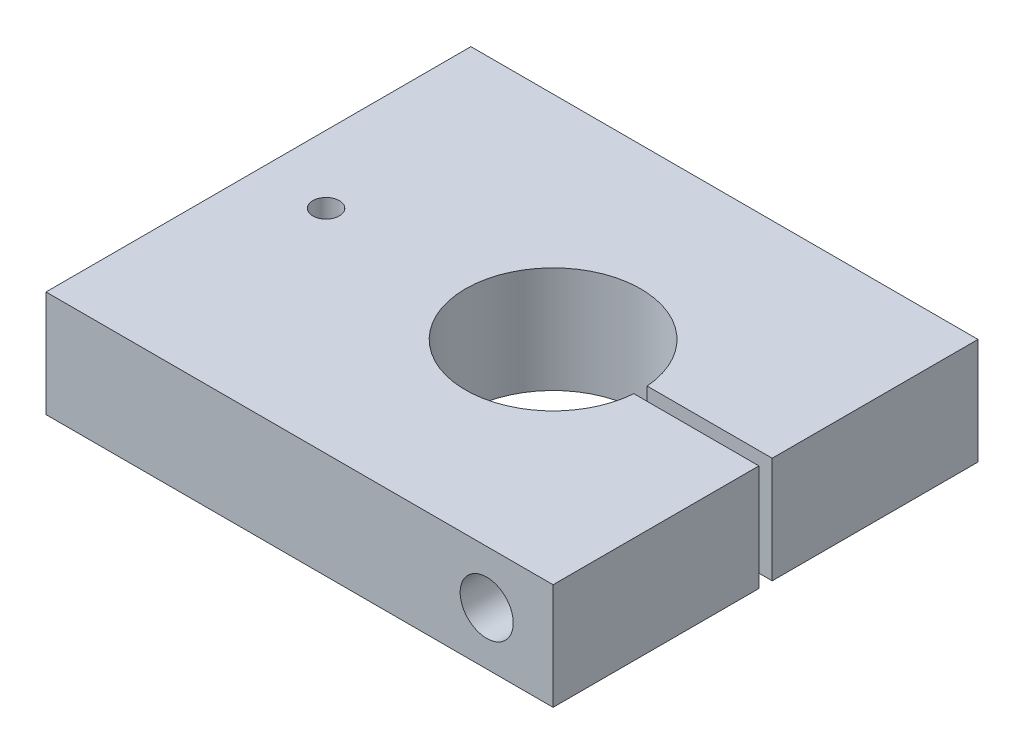
ISO-10303-21;
HEADER;
FILE_DESCRIPTION(('STEP AP214'),'2;1');
FILE_NAME('part.step','',(''),(''),'','','');
FILE_SCHEMA(('AUTOMOTIVE_DESIGN { 1 0 10303 214 1 1 1 1 }'));
ENDSEC;
DATA;
#1=APPLICATION_CONTEXT('core data for automotive mechanical design processes');
#2=APPLICATION_PROTOCOL_DEFINITION('international standard','automotive_design',2000,#1);
#3=PRODUCT_CONTEXT('',#1,'mechanical');
#4=PRODUCT('Part','Part','',(#3));
#5=PRODUCT_RELATED_PRODUCT_CATEGORY('part','',(#4));
#6=PRODUCT_DEFINITION_FORMATION('','',#4);
#7=PRODUCT_DEFINITION_CONTEXT('part definition',#1,'design');
#8=PRODUCT_DEFINITION('design','',#6,#7);
#9=PRODUCT_DEFINITION_SHAPE('','',#8);
#10=(LENGTH_UNIT() NAMED_UNIT(*) SI_UNIT(.MILLI.,.METRE.));
#11=(NAMED_UNIT(*) PLANE_ANGLE_UNIT() SI_UNIT($,.RADIAN.));
#12=(NAMED_UNIT(*) SI_UNIT($,.STERADIAN.) SOLID_ANGLE_UNIT());
#13=UNCERTAINTY_MEASURE_WITH_UNIT(LENGTH_MEASURE(1.E-05),#10,'distance_accuracy_value','');
#14=(GEOMETRIC_REPRESENTATION_CONTEXT(3) GLOBAL_UNCERTAINTY_ASSIGNED_CONTEXT((#13)) GLOBAL_UNIT_ASSIGNED_CONTEXT((#10,
#11,#12)) REPRESENTATION_CONTEXT('',''));
#15=CARTESIAN_POINT('',(0.,0.,0.));
#16=DIRECTION('',(0.,0.,1.));
#17=DIRECTION('',(1.,0.,0.));
#18=AXIS2_PLACEMENT_3D('',#15,#16,#17);
#19=CARTESIAN_POINT('',(203.2,25.4,0.));
#20=DIRECTION('',(-1.,0.,0.));
#21=DIRECTION('',(0.,0.,1.));
#22=AXIS2_PLACEMENT_3D('',#19,#20,#21);
#23=PLANE('',#22);
#24=DIRECTION('',(0.,0.,-1.));
#25=VECTOR('',#24,1.);
#26=CARTESIAN_POINT('',(203.2,0.,0.));
#27=LINE('',#26,#25);
#28=CARTESIAN_POINT('',(203.2,0.,0.));
#29=VERTEX_POINT('',#28);
#30=CARTESIAN_POINT('',(203.2,0.,-49.2125));
#31=VERTEX_POINT('',#30);
#32=EDGE_CURVE('E121',#29,#31,#27,.T.);
#33=ORIENTED_EDGE('',*,*,#32,.T.);
#34=DIRECTION('',(0.,1.,0.));
#35=VECTOR('',#34,1.);
#36=CARTESIAN_POINT('',(203.2,0.,-49.2125));
#37=LINE('',#36,#35);
#38=CARTESIAN_POINT('',(203.2,25.4,-49.2125));
#39=VERTEX_POINT('',#38);
#40=EDGE_CURVE('E115',#31,#39,#37,.T.);
#41=ORIENTED_EDGE('',*,*,#40,.T.);
#42=DIRECTION('',(0.,0.,-1.));
#43=VECTOR('',#42,1.);
#44=CARTESIAN_POINT('',(203.2,25.4,0.));
#45=LINE('',#44,#43);
#46=CARTESIAN_POINT('',(203.2,25.4,0.));
#47=VERTEX_POINT('',#46);
#48=EDGE_CURVE('E172',#47,#39,#45,.T.);
#49=ORIENTED_EDGE('',*,*,#48,.F.);
#50=DIRECTION('',(0.,-1.,0.));
#51=VECTOR('',#50,1.);
#52=CARTESIAN_POINT('',(203.2,25.4,0.));
#53=LINE('',#52,#51);
#54=EDGE_CURVE('E137',#47,#29,#53,.T.);
#55=ORIENTED_EDGE('',*,*,#54,.T.);
#56=EDGE_LOOP('',(#33,#41,#49,#55));
#57=FACE_BOUND('',#56,.T.);
#58=ADVANCED_FACE('F32',(#57),#23,.F.);
#59=CARTESIAN_POINT('',(187.325,12.7,-101.6));
#60=DIRECTION('',(0.,0.,1.));
#61=DIRECTION('',(1.,0.,0.));
#62=AXIS2_PLACEMENT_3D('',#59,#60,#61);
#63=CYLINDRICAL_SURFACE('',#62,6.34999999999997);
#64=CARTESIAN_POINT('',(187.325,12.7,-49.2125));
#65=DIRECTION('',(0.,0.,1.));
#66=DIRECTION('',(1.,0.,0.));
#67=AXIS2_PLACEMENT_3D('',#64,#65,#66);
#68=CIRCLE('',#67,6.34999999999997);
#69=CARTESIAN_POINT('',(193.675,12.7,-49.2125));
#70=VERTEX_POINT('',#69);
#71=EDGE_CURVE('E36',#70,#70,#68,.F.);
#72=ORIENTED_EDGE('',*,*,#71,.T.);
#73=EDGE_LOOP('',(#72));
#74=FACE_BOUND('',#73,.T.);
#75=CARTESIAN_POINT('',(187.325,12.7,0.));
#76=DIRECTION('',(0.,0.,1.));
#77=DIRECTION('',(1.,0.,0.));
#78=AXIS2_PLACEMENT_3D('',#75,#76,#77);
#79=CIRCLE('',#78,6.34999999999997);
#80=CARTESIAN_POINT('',(193.675,12.7,0.));
#81=VERTEX_POINT('',#80);
#82=EDGE_CURVE('E159',#81,#81,#79,.T.);
#83=ORIENTED_EDGE('',*,*,#82,.T.);
#84=EDGE_LOOP('',(#83));
#85=FACE_BOUND('',#84,.T.);
#86=ADVANCED_FACE('F189',(#74,#85),#63,.F.);
#87=CARTESIAN_POINT('',(0.,25.4,0.));
#88=DIRECTION('',(0.,-1.,0.));
#89=DIRECTION('',(0.,0.,-1.));
#90=AXIS2_PLACEMENT_3D('',#87,#88,#89);
#91=PLANE('',#90);
#92=ORIENTED_EDGE('',*,*,#48,.T.);
#93=DIRECTION('',(1.,0.,0.));
#94=VECTOR('',#93,1.);
#95=CARTESIAN_POINT('',(203.2,25.4,-49.2125));
#96=LINE('',#95,#94);
#97=CARTESIAN_POINT('',(173.294780897392,25.4,-49.2125));
#98=VERTEX_POINT('',#97);
#99=EDGE_CURVE('E107',#98,#39,#96,.T.);
#100=ORIENTED_EDGE('',*,*,#99,.F.);
#101=CARTESIAN_POINT('',(152.4,25.4,-50.8));
#102=DIRECTION('',(0.,1.,0.));
#103=DIRECTION('',(0.,0.,1.));
#104=AXIS2_PLACEMENT_3D('',#101,#102,#103);
#105=CIRCLE('',#104,20.955);
#106=CARTESIAN_POINT('',(173.294780897392,25.4,-52.3875));
#107=VERTEX_POINT('',#106);
#108=EDGE_CURVE('E122',#107,#98,#105,.T.);
#109=ORIENTED_EDGE('',*,*,#108,.F.);
#110=DIRECTION('',(-1.,0.,0.));
#111=VECTOR('',#110,1.);
#112=CARTESIAN_POINT('',(203.2,25.4,-52.3875));
#113=LINE('',#112,#111);
#114=CARTESIAN_POINT('',(203.2,25.4,-52.3875));
#115=VERTEX_POINT('',#114);
#116=EDGE_CURVE('E57',#115,#107,#113,.T.);
#117=ORIENTED_EDGE('',*,*,#116,.F.);
#118=CARTESIAN_POINT('',(203.2,25.4,-101.6));
#119=VERTEX_POINT('',#118);
#120=EDGE_CURVE('E114',#115,#119,#45,.T.);
#121=ORIENTED_EDGE('',*,*,#120,.T.);
#122=DIRECTION('',(-1.,0.,0.));
#123=VECTOR('',#122,1.);
#124=CARTESIAN_POINT('',(81.950976157473,25.4,-101.6));
#125=LINE('',#124,#123);
#126=CARTESIAN_POINT('',(81.950976157473,25.4,-101.6));
#127=VERTEX_POINT('',#126);
#128=EDGE_CURVE('E174',#119,#127,#125,.T.);
#129=ORIENTED_EDGE('',*,*,#128,.T.);
#130=DIRECTION('',(0.,0.,1.));
#131=VECTOR('',#130,1.);
#132=CARTESIAN_POINT('',(81.950976157473,25.4,-101.6));
#133=LINE('',#132,#131);
#134=CARTESIAN_POINT('',(81.950976157473,25.4,0.));
#135=VERTEX_POINT('',#134);
#136=EDGE_CURVE('E175',#127,#135,#133,.T.);
#137=ORIENTED_EDGE('',*,*,#136,.T.);
#138=DIRECTION('',(1.,0.,0.));
#139=VECTOR('',#138,1.);
#140=CARTESIAN_POINT('',(81.950976157473,25.4,0.));
#141=LINE('',#140,#139);
#142=EDGE_CURVE('E130',#135,#47,#141,.T.);
#143=ORIENTED_EDGE('',*,*,#142,.T.);
#144=EDGE_LOOP('',(#92,#100,#109,#117,#121,#129,#137,#143));
#145=FACE_BOUND('',#144,.T.);
#146=CARTESIAN_POINT('',(98.1075,25.4,-50.8));
#147=DIRECTION('',(0.,1.,0.));
#148=DIRECTION('',(0.,0.,1.));
#149=AXIS2_PLACEMENT_3D('',#146,#147,#148);
#150=CIRCLE('',#149,3.175);
#151=CARTESIAN_POINT('',(98.1075,25.4,-47.625));
#152=VERTEX_POINT('',#151);
#153=EDGE_CURVE('E166',#152,#152,#150,.T.);
#154=ORIENTED_EDGE('',*,*,#153,.F.);
#155=EDGE_LOOP('',(#154));
#156=FACE_BOUND('',#155,.T.);
#157=ADVANCED_FACE('F181',(#145,#156),#91,.F.);
#158=CARTESIAN_POINT('',(0.,0.,0.));
#159=DIRECTION('',(0.,-1.,0.));
#160=DIRECTION('',(0.,0.,-1.));
#161=AXIS2_PLACEMENT_3D('',#158,#159,#160);
#162=PLANE('',#161);
#163=DIRECTION('',(1.,0.,0.));
#164=VECTOR('',#163,1.);
#165=CARTESIAN_POINT('',(203.2,0.,-49.2125));
#166=LINE('',#165,#164);
#167=CARTESIAN_POINT('',(173.294780897392,0.,-49.2125));
#168=VERTEX_POINT('',#167);
#169=EDGE_CURVE('E49',#168,#31,#166,.T.);
#170=ORIENTED_EDGE('',*,*,#169,.T.);
#171=ORIENTED_EDGE('',*,*,#32,.F.);
#172=DIRECTION('',(1.,0.,0.));
#173=VECTOR('',#172,1.);
#174=CARTESIAN_POINT('',(81.950976157473,0.,0.));
#175=LINE('',#174,#173);
#176=CARTESIAN_POINT('',(81.950976157473,0.,0.));
#177=VERTEX_POINT('',#176);
#178=EDGE_CURVE('E135',#177,#29,#175,.T.);
#179=ORIENTED_EDGE('',*,*,#178,.F.);
#180=DIRECTION('',(0.,0.,1.));
#181=VECTOR('',#180,1.);
#182=CARTESIAN_POINT('',(81.950976157473,0.,-101.6));
#183=LINE('',#182,#181);
#184=CARTESIAN_POINT('',(81.950976157473,0.,-101.6));
#185=VERTEX_POINT('',#184);
#186=EDGE_CURVE('E133',#185,#177,#183,.T.);
#187=ORIENTED_EDGE('',*,*,#186,.F.);
#188=DIRECTION('',(-1.,0.,0.));
#189=VECTOR('',#188,1.);
#190=CARTESIAN_POINT('',(81.950976157473,0.,-101.6));
#191=LINE('',#190,#189);
#192=CARTESIAN_POINT('',(203.2,0.,-101.6));
#193=VERTEX_POINT('',#192);
#194=EDGE_CURVE('E120',#193,#185,#191,.T.);
#195=ORIENTED_EDGE('',*,*,#194,.F.);
#196=CARTESIAN_POINT('',(203.2,0.,-52.3875));
#197=VERTEX_POINT('',#196);
#198=EDGE_CURVE('E112',#197,#193,#27,.T.);
#199=ORIENTED_EDGE('',*,*,#198,.F.);
#200=DIRECTION('',(-1.,0.,0.));
#201=VECTOR('',#200,1.);
#202=CARTESIAN_POINT('',(203.2,0.,-52.3875));
#203=LINE('',#202,#201);
#204=CARTESIAN_POINT('',(173.294780897392,0.,-52.3875));
#205=VERTEX_POINT('',#204);
#206=EDGE_CURVE('E97',#197,#205,#203,.T.);
#207=ORIENTED_EDGE('',*,*,#206,.T.);
#208=CARTESIAN_POINT('',(152.4,0.,-50.8));
#209=DIRECTION('',(0.,1.,0.));
#210=DIRECTION('',(0.,0.,1.));
#211=AXIS2_PLACEMENT_3D('',#208,#209,#210);
#212=CIRCLE('',#211,20.955);
#213=EDGE_CURVE('E126',#205,#168,#212,.T.);
#214=ORIENTED_EDGE('',*,*,#213,.T.);
#215=EDGE_LOOP('',(#170,#171,#179,#187,#195,#199,#207,#214));
#216=FACE_BOUND('',#215,.T.);
#217=CARTESIAN_POINT('',(98.1075,0.,-50.8));
#218=DIRECTION('',(0.,1.,0.));
#219=DIRECTION('',(0.,0.,1.));
#220=AXIS2_PLACEMENT_3D('',#217,#218,#219);
#221=CIRCLE('',#220,3.175);
#222=CARTESIAN_POINT('',(98.1075,0.,-47.625));
#223=VERTEX_POINT('',#222);
#224=EDGE_CURVE('E163',#223,#223,#221,.T.);
#225=ORIENTED_EDGE('',*,*,#224,.T.);
#226=EDGE_LOOP('',(#225));
#227=FACE_BOUND('',#226,.T.);
#228=ADVANCED_FACE('F117',(#216,#227),#162,.T.);
#229=ORIENTED_EDGE('',*,*,#120,.F.);
#230=DIRECTION('',(0.,1.,0.));
#231=VECTOR('',#230,1.);
#232=CARTESIAN_POINT('',(203.2,0.,-52.3875));
#233=LINE('',#232,#231);
#234=EDGE_CURVE('E101',#197,#115,#233,.T.);
#235=ORIENTED_EDGE('',*,*,#234,.F.);
#236=ORIENTED_EDGE('',*,*,#198,.T.);
#237=DIRECTION('',(0.,-1.,0.));
#238=VECTOR('',#237,1.);
#239=CARTESIAN_POINT('',(203.2,25.4,-101.6));
#240=LINE('',#239,#238);
#241=EDGE_CURVE('E11',#119,#193,#240,.T.);
#242=ORIENTED_EDGE('',*,*,#241,.F.);
#243=EDGE_LOOP('',(#229,#235,#236,#242));
#244=FACE_BOUND('',#243,.T.);
#245=ADVANCED_FACE('F34',(#244),#23,.F.);
#246=CARTESIAN_POINT('',(81.950976157473,25.4,-101.6));
#247=DIRECTION('',(0.,0.,1.));
#248=DIRECTION('',(1.,0.,0.));
#249=AXIS2_PLACEMENT_3D('',#246,#247,#248);
#250=PLANE('',#249);
#251=CARTESIAN_POINT('',(187.325,12.7,-101.6));
#252=DIRECTION('',(0.,0.,1.));
#253=DIRECTION('',(1.,0.,0.));
#254=AXIS2_PLACEMENT_3D('',#251,#252,#253);
#255=CIRCLE('',#254,6.34999999999997);
#256=CARTESIAN_POINT('',(193.675,12.7,-101.6));
#257=VERTEX_POINT('',#256);
#258=EDGE_CURVE('E160',#257,#257,#255,.T.);
#259=ORIENTED_EDGE('',*,*,#258,.T.);
#260=EDGE_LOOP('',(#259));
#261=FACE_BOUND('',#260,.T.);
#262=ORIENTED_EDGE('',*,*,#194,.T.);
#263=DIRECTION('',(0.,-1.,0.));
#264=VECTOR('',#263,1.);
#265=CARTESIAN_POINT('',(81.950976157473,25.4,-101.6));
#266=LINE('',#265,#264);
#267=EDGE_CURVE('E41',#127,#185,#266,.T.);
#268=ORIENTED_EDGE('',*,*,#267,.F.);
#269=ORIENTED_EDGE('',*,*,#128,.F.);
#270=ORIENTED_EDGE('',*,*,#241,.T.);
#271=EDGE_LOOP('',(#262,#268,#269,#270));
#272=FACE_BOUND('',#271,.T.);
#273=ADVANCED_FACE('F197',(#261,#272),#250,.F.);
#274=CARTESIAN_POINT('',(81.950976157473,25.4,-101.6));
#275=DIRECTION('',(1.,0.,0.));
#276=DIRECTION('',(0.,0.,-1.));
#277=AXIS2_PLACEMENT_3D('',#274,#275,#276);
#278=PLANE('',#277);
#279=ORIENTED_EDGE('',*,*,#186,.T.);
#280=DIRECTION('',(0.,-1.,0.));
#281=VECTOR('',#280,1.);
#282=CARTESIAN_POINT('',(81.950976157473,25.4,0.));
#283=LINE('',#282,#281);
#284=EDGE_CURVE('E140',#135,#177,#283,.T.);
#285=ORIENTED_EDGE('',*,*,#284,.F.);
#286=ORIENTED_EDGE('',*,*,#136,.F.);
#287=ORIENTED_EDGE('',*,*,#267,.T.);
#288=EDGE_LOOP('',(#279,#285,#286,#287));
#289=FACE_BOUND('',#288,.T.);
#290=ADVANCED_FACE('F202',(#289),#278,.F.);
#291=CARTESIAN_POINT('',(81.950976157473,25.4,0.));
#292=DIRECTION('',(0.,0.,-1.));
#293=DIRECTION('',(-1.,0.,0.));
#294=AXIS2_PLACEMENT_3D('',#291,#292,#293);
#295=PLANE('',#294);
#296=ORIENTED_EDGE('',*,*,#82,.F.);
#297=EDGE_LOOP('',(#296));
#298=FACE_BOUND('',#297,.T.);
#299=ORIENTED_EDGE('',*,*,#178,.T.);
#300=ORIENTED_EDGE('',*,*,#54,.F.);
#301=ORIENTED_EDGE('',*,*,#142,.F.);
#302=ORIENTED_EDGE('',*,*,#284,.T.);
#303=EDGE_LOOP('',(#299,#300,#301,#302));
#304=FACE_BOUND('',#303,.T.);
#305=ADVANCED_FACE('F185',(#298,#304),#295,.F.);
#306=CARTESIAN_POINT('',(152.4,25.4,-50.8));
#307=DIRECTION('',(0.,-1.,0.));
#308=DIRECTION('',(0.,0.,-1.));
#309=AXIS2_PLACEMENT_3D('',#306,#307,#308);
#310=CYLINDRICAL_SURFACE('',#309,20.955);
#311=DIRECTION('',(0.,-1.,0.));
#312=VECTOR('',#311,1.);
#313=CARTESIAN_POINT('',(173.294780897392,25.4,-49.2125));
#314=LINE('',#313,#312);
#315=EDGE_CURVE('E157',#168,#98,#314,.F.);
#316=ORIENTED_EDGE('',*,*,#315,.F.);
#317=ORIENTED_EDGE('',*,*,#213,.F.);
#318=DIRECTION('',(0.,-1.,0.));
#319=VECTOR('',#318,1.);
#320=CARTESIAN_POINT('',(173.294780897392,25.4,-52.3875));
#321=LINE('',#320,#319);
#322=EDGE_CURVE('E102',#107,#205,#321,.T.);
#323=ORIENTED_EDGE('',*,*,#322,.F.);
#324=ORIENTED_EDGE('',*,*,#108,.T.);
#325=EDGE_LOOP('',(#316,#317,#323,#324));
#326=FACE_BOUND('',#325,.T.);
#327=ADVANCED_FACE('F213',(#326),#310,.F.);
#328=CARTESIAN_POINT('',(98.1075,25.4,-50.8));
#329=DIRECTION('',(0.,-1.,0.));
#330=DIRECTION('',(0.,0.,-1.));
#331=AXIS2_PLACEMENT_3D('',#328,#329,#330);
#332=CYLINDRICAL_SURFACE('',#331,3.175);
#333=ORIENTED_EDGE('',*,*,#153,.T.);
#334=EDGE_LOOP('',(#333));
#335=FACE_BOUND('',#334,.T.);
#336=ORIENTED_EDGE('',*,*,#224,.F.);
#337=EDGE_LOOP('',(#336));
#338=FACE_BOUND('',#337,.T.);
#339=ADVANCED_FACE('F226',(#335,#338),#332,.F.);
#340=CARTESIAN_POINT('',(187.325,12.7,-52.3875));
#341=DIRECTION('',(0.,0.,-1.));
#342=DIRECTION('',(-1.,0.,0.));
#343=AXIS2_PLACEMENT_3D('',#340,#341,#342);
#344=CIRCLE('',#343,6.34999999999997);
#345=CARTESIAN_POINT('',(180.975,12.7,-52.3875));
#346=VERTEX_POINT('',#345);
#347=EDGE_CURVE('E144',#346,#346,#344,.F.);
#348=ORIENTED_EDGE('',*,*,#347,.T.);
#349=EDGE_LOOP('',(#348));
#350=FACE_BOUND('',#349,.T.);
#351=ORIENTED_EDGE('',*,*,#258,.F.);
#352=EDGE_LOOP('',(#351));
#353=FACE_BOUND('',#352,.T.);
#354=ADVANCED_FACE('F195',(#350,#353),#63,.F.);
#355=CARTESIAN_POINT('',(203.2,0.,-52.3875));
#356=DIRECTION('',(0.,0.,-1.));
#357=DIRECTION('',(-1.,0.,0.));
#358=AXIS2_PLACEMENT_3D('',#355,#356,#357);
#359=PLANE('',#358);
#360=ORIENTED_EDGE('',*,*,#322,.T.);
#361=ORIENTED_EDGE('',*,*,#206,.F.);
#362=ORIENTED_EDGE('',*,*,#234,.T.);
#363=ORIENTED_EDGE('',*,*,#116,.T.);
#364=EDGE_LOOP('',(#360,#361,#362,#363));
#365=FACE_BOUND('',#364,.T.);
#366=ORIENTED_EDGE('',*,*,#347,.F.);
#367=EDGE_LOOP('',(#366));
#368=FACE_BOUND('',#367,.T.);
#369=ADVANCED_FACE('F99',(#365,#368),#359,.F.);
#370=CARTESIAN_POINT('',(203.2,0.,-49.2125));
#371=DIRECTION('',(0.,0.,1.));
#372=DIRECTION('',(1.,0.,0.));
#373=AXIS2_PLACEMENT_3D('',#370,#371,#372);
#374=PLANE('',#373);
#375=ORIENTED_EDGE('',*,*,#315,.T.);
#376=ORIENTED_EDGE('',*,*,#99,.T.);
#377=ORIENTED_EDGE('',*,*,#40,.F.);
#378=ORIENTED_EDGE('',*,*,#169,.F.);
#379=EDGE_LOOP('',(#375,#376,#377,#378));
#380=FACE_BOUND('',#379,.T.);
#381=ORIENTED_EDGE('',*,*,#71,.F.);
#382=EDGE_LOOP('',(#381));
#383=FACE_BOUND('',#382,.T.);
#384=ADVANCED_FACE('F221',(#380,#383),#374,.F.);
#385=CLOSED_SHELL('',(#58,#86,#157,#228,#245,#273,#290,#305,#327,#339,#354,#369,#384));
#386=MANIFOLD_SOLID_BREP('B2',#385);
#387=ADVANCED_BREP_SHAPE_REPRESENTATION('',(#18,#386),#14);
#388=SHAPE_DEFINITION_REPRESENTATION(#9,#387);
ENDSEC;
END-ISO-10303-21;
